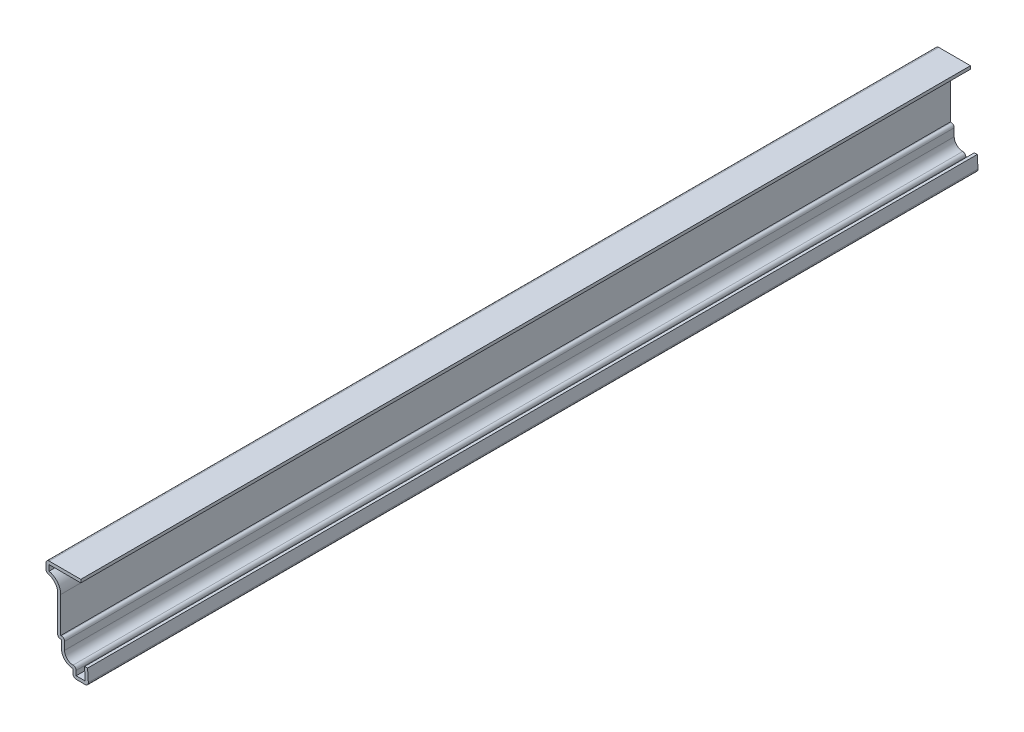
ISO-10303-21;
HEADER;
FILE_DESCRIPTION(('STEP AP214'),'2;1');
FILE_NAME('part.step','',(''),(''),'','','');
FILE_SCHEMA(('AUTOMOTIVE_DESIGN { 1 0 10303 214 1 1 1 1 }'));
ENDSEC;
DATA;
#1=APPLICATION_CONTEXT('core data for automotive mechanical design processes');
#2=APPLICATION_PROTOCOL_DEFINITION('international standard','automotive_design',2000,#1);
#3=PRODUCT_CONTEXT('',#1,'mechanical');
#4=PRODUCT('Part','Part','',(#3));
#5=PRODUCT_RELATED_PRODUCT_CATEGORY('part','',(#4));
#6=PRODUCT_DEFINITION_FORMATION('','',#4);
#7=PRODUCT_DEFINITION_CONTEXT('part definition',#1,'design');
#8=PRODUCT_DEFINITION('design','',#6,#7);
#9=PRODUCT_DEFINITION_SHAPE('','',#8);
#10=(LENGTH_UNIT() NAMED_UNIT(*) SI_UNIT(.MILLI.,.METRE.));
#11=(NAMED_UNIT(*) PLANE_ANGLE_UNIT() SI_UNIT($,.RADIAN.));
#12=(NAMED_UNIT(*) SI_UNIT($,.STERADIAN.) SOLID_ANGLE_UNIT());
#13=UNCERTAINTY_MEASURE_WITH_UNIT(LENGTH_MEASURE(1.E-05),#10,'distance_accuracy_value','');
#14=(GEOMETRIC_REPRESENTATION_CONTEXT(3) GLOBAL_UNCERTAINTY_ASSIGNED_CONTEXT((#13)) GLOBAL_UNIT_ASSIGNED_CONTEXT((#10,
#11,#12)) REPRESENTATION_CONTEXT('',''));
#15=CARTESIAN_POINT('',(0.,0.,0.));
#16=DIRECTION('',(0.,0.,1.));
#17=DIRECTION('',(1.,0.,0.));
#18=AXIS2_PLACEMENT_3D('',#15,#16,#17);
#19=CARTESIAN_POINT('',(-17.4625,35.2425,-365.125));
#20=DIRECTION('',(0.,-1.,0.));
#21=DIRECTION('',(1.,0.,0.));
#22=AXIS2_PLACEMENT_3D('',#19,#20,#21);
#23=PLANE('',#22);
#24=DIRECTION('',(1.,0.,0.));
#25=VECTOR('',#24,1.);
#26=CARTESIAN_POINT('',(-17.4625,35.2425,0.));
#27=LINE('',#26,#25);
#28=CARTESIAN_POINT('',(-16.1925,35.2425,0.));
#29=VERTEX_POINT('',#28);
#30=CARTESIAN_POINT('',(-3.175,35.2425,0.));
#31=VERTEX_POINT('',#30);
#32=EDGE_CURVE('E305',#29,#31,#27,.T.);
#33=ORIENTED_EDGE('',*,*,#32,.F.);
#34=DIRECTION('',(0.,0.,1.));
#35=VECTOR('',#34,1.);
#36=CARTESIAN_POINT('',(-16.1925,35.2425,-365.125));
#37=LINE('',#36,#35);
#38=CARTESIAN_POINT('',(-16.1925,35.2425,-365.125));
#39=VERTEX_POINT('',#38);
#40=EDGE_CURVE('E251',#39,#29,#37,.T.);
#41=ORIENTED_EDGE('',*,*,#40,.F.);
#42=DIRECTION('',(1.,0.,0.));
#43=VECTOR('',#42,1.);
#44=CARTESIAN_POINT('',(-17.4625,35.2425,-365.125));
#45=LINE('',#44,#43);
#46=CARTESIAN_POINT('',(-3.175,35.2425,-365.125));
#47=VERTEX_POINT('',#46);
#48=EDGE_CURVE('E233',#39,#47,#45,.T.);
#49=ORIENTED_EDGE('',*,*,#48,.T.);
#50=DIRECTION('',(0.,0.,1.));
#51=VECTOR('',#50,1.);
#52=CARTESIAN_POINT('',(-3.175,35.2425,-365.125));
#53=LINE('',#52,#51);
#54=EDGE_CURVE('E241',#47,#31,#53,.T.);
#55=ORIENTED_EDGE('',*,*,#54,.T.);
#56=EDGE_LOOP('',(#33,#41,#49,#55));
#57=FACE_BOUND('',#56,.T.);
#58=ADVANCED_FACE('F35',(#57),#23,.T.);
#59=CARTESIAN_POINT('',(-16.1925,31.75,-365.125));
#60=DIRECTION('',(1.,0.,0.));
#61=DIRECTION('',(0.,0.,-1.));
#62=AXIS2_PLACEMENT_3D('',#59,#60,#61);
#63=PLANE('',#62);
#64=DIRECTION('',(0.,1.,0.));
#65=VECTOR('',#64,1.);
#66=CARTESIAN_POINT('',(-16.1925,31.75,0.));
#67=LINE('',#66,#65);
#68=CARTESIAN_POINT('',(-16.1925,32.8848007596696,0.));
#69=VERTEX_POINT('',#68);
#70=EDGE_CURVE('E252',#69,#29,#67,.T.);
#71=ORIENTED_EDGE('',*,*,#70,.F.);
#72=DIRECTION('',(0.,0.,1.));
#73=VECTOR('',#72,1.);
#74=CARTESIAN_POINT('',(-16.1925,32.8848007596696,-365.125));
#75=LINE('',#74,#73);
#76=CARTESIAN_POINT('',(-16.1925,32.8848007596696,-365.125));
#77=VERTEX_POINT('',#76);
#78=EDGE_CURVE('E357',#77,#69,#75,.T.);
#79=ORIENTED_EDGE('',*,*,#78,.F.);
#80=DIRECTION('',(0.,1.,0.));
#81=VECTOR('',#80,1.);
#82=CARTESIAN_POINT('',(-16.1925,31.75,-365.125));
#83=LINE('',#82,#81);
#84=EDGE_CURVE('E249',#77,#39,#83,.T.);
#85=ORIENTED_EDGE('',*,*,#84,.T.);
#86=ORIENTED_EDGE('',*,*,#40,.T.);
#87=EDGE_LOOP('',(#71,#79,#85,#86));
#88=FACE_BOUND('',#87,.T.);
#89=ADVANCED_FACE('F467',(#88),#63,.T.);
#90=CARTESIAN_POINT('',(-17.4625,26.9875,-365.125));
#91=DIRECTION('',(0.,0.,1.));
#92=DIRECTION('',(1.,0.,0.));
#93=AXIS2_PLACEMENT_3D('',#90,#91,#92);
#94=CYLINDRICAL_SURFACE('',#93,6.0325);
#95=CARTESIAN_POINT('',(-17.4625,26.9875,0.));
#96=DIRECTION('',(0.,0.,1.));
#97=DIRECTION('',(1.,0.,0.));
#98=AXIS2_PLACEMENT_3D('',#95,#96,#97);
#99=CIRCLE('',#98,6.0325);
#100=CARTESIAN_POINT('',(-11.43,26.9875,0.));
#101=VERTEX_POINT('',#100);
#102=EDGE_CURVE('E255',#101,#69,#99,.T.);
#103=ORIENTED_EDGE('',*,*,#102,.F.);
#104=DIRECTION('',(0.,0.,1.));
#105=VECTOR('',#104,1.);
#106=CARTESIAN_POINT('',(-11.43,26.9875,-365.125));
#107=LINE('',#106,#105);
#108=CARTESIAN_POINT('',(-11.43,26.9875,-365.125));
#109=VERTEX_POINT('',#108);
#110=EDGE_CURVE('E359',#109,#101,#107,.T.);
#111=ORIENTED_EDGE('',*,*,#110,.F.);
#112=CARTESIAN_POINT('',(-17.4625,26.9875,-365.125));
#113=DIRECTION('',(0.,0.,1.));
#114=DIRECTION('',(1.,0.,0.));
#115=AXIS2_PLACEMENT_3D('',#112,#113,#114);
#116=CIRCLE('',#115,6.0325);
#117=EDGE_CURVE('E301',#109,#77,#116,.T.);
#118=ORIENTED_EDGE('',*,*,#117,.T.);
#119=ORIENTED_EDGE('',*,*,#78,.T.);
#120=EDGE_LOOP('',(#103,#111,#118,#119));
#121=FACE_BOUND('',#120,.T.);
#122=ADVANCED_FACE('F571',(#121),#94,.T.);
#123=CARTESIAN_POINT('',(-11.43,11.1125,-365.125));
#124=DIRECTION('',(1.,0.,0.));
#125=DIRECTION('',(0.,0.,-1.));
#126=AXIS2_PLACEMENT_3D('',#123,#124,#125);
#127=PLANE('',#126);
#128=DIRECTION('',(0.,1.,0.));
#129=VECTOR('',#128,1.);
#130=CARTESIAN_POINT('',(-11.43,11.1125,0.));
#131=LINE('',#130,#129);
#132=CARTESIAN_POINT('',(-11.43,12.3825,0.));
#133=VERTEX_POINT('',#132);
#134=EDGE_CURVE('E350',#133,#101,#131,.T.);
#135=ORIENTED_EDGE('',*,*,#134,.F.);
#136=DIRECTION('',(0.,0.,1.));
#137=VECTOR('',#136,1.);
#138=CARTESIAN_POINT('',(-11.43,12.3825,-365.125));
#139=LINE('',#138,#137);
#140=CARTESIAN_POINT('',(-11.43,12.3825,-365.125));
#141=VERTEX_POINT('',#140);
#142=EDGE_CURVE('E361',#141,#133,#139,.T.);
#143=ORIENTED_EDGE('',*,*,#142,.F.);
#144=DIRECTION('',(0.,1.,0.));
#145=VECTOR('',#144,1.);
#146=CARTESIAN_POINT('',(-11.43,11.1125,-365.125));
#147=LINE('',#146,#145);
#148=EDGE_CURVE('E298',#141,#109,#147,.T.);
#149=ORIENTED_EDGE('',*,*,#148,.T.);
#150=ORIENTED_EDGE('',*,*,#110,.T.);
#151=EDGE_LOOP('',(#135,#143,#149,#150));
#152=FACE_BOUND('',#151,.T.);
#153=ADVANCED_FACE('F475',(#152),#127,.T.);
#154=CARTESIAN_POINT('',(-11.1125,12.3825,-365.125));
#155=DIRECTION('',(0.,1.,0.));
#156=DIRECTION('',(0.,0.,1.));
#157=AXIS2_PLACEMENT_3D('',#154,#155,#156);
#158=PLANE('',#157);
#159=DIRECTION('',(1.,0.,0.));
#160=VECTOR('',#159,1.);
#161=CARTESIAN_POINT('',(-11.1125,12.3825,0.));
#162=LINE('',#161,#160);
#163=CARTESIAN_POINT('',(-11.1125,12.3825,0.));
#164=VERTEX_POINT('',#163);
#165=EDGE_CURVE('E348',#164,#133,#162,.F.);
#166=ORIENTED_EDGE('',*,*,#165,.F.);
#167=DIRECTION('',(0.,0.,1.));
#168=VECTOR('',#167,1.);
#169=CARTESIAN_POINT('',(-11.1125,12.3825,-365.125));
#170=LINE('',#169,#168);
#171=CARTESIAN_POINT('',(-11.1125,12.3825,-365.125));
#172=VERTEX_POINT('',#171);
#173=EDGE_CURVE('E433',#164,#172,#170,.F.);
#174=ORIENTED_EDGE('',*,*,#173,.T.);
#175=DIRECTION('',(1.,0.,0.));
#176=VECTOR('',#175,1.);
#177=CARTESIAN_POINT('',(-11.1125,12.3825,-365.125));
#178=LINE('',#177,#176);
#179=EDGE_CURVE('E296',#172,#141,#178,.F.);
#180=ORIENTED_EDGE('',*,*,#179,.T.);
#181=ORIENTED_EDGE('',*,*,#142,.T.);
#182=EDGE_LOOP('',(#166,#174,#180,#181));
#183=FACE_BOUND('',#182,.T.);
#184=ADVANCED_FACE('F478',(#183),#158,.T.);
#185=CARTESIAN_POINT('',(-9.8425,7.9375,-365.125));
#186=DIRECTION('',(1.,0.,0.));
#187=DIRECTION('',(0.,1.,0.));
#188=AXIS2_PLACEMENT_3D('',#185,#186,#187);
#189=PLANE('',#188);
#190=DIRECTION('',(0.,1.,0.));
#191=VECTOR('',#190,1.);
#192=CARTESIAN_POINT('',(-9.8425,7.9375,-365.125));
#193=LINE('',#192,#191);
#194=CARTESIAN_POINT('',(-9.8425,7.9375,-365.125));
#195=VERTEX_POINT('',#194);
#196=CARTESIAN_POINT('',(-9.8425,11.1125,-365.125));
#197=VERTEX_POINT('',#196);
#198=EDGE_CURVE('E293',#195,#197,#193,.T.);
#199=ORIENTED_EDGE('',*,*,#198,.T.);
#200=DIRECTION('',(0.,0.,1.));
#201=VECTOR('',#200,1.);
#202=CARTESIAN_POINT('',(-9.8425,11.1125,-365.125));
#203=LINE('',#202,#201);
#204=CARTESIAN_POINT('',(-9.8425,11.1125,0.));
#205=VERTEX_POINT('',#204);
#206=EDGE_CURVE('E430',#197,#205,#203,.T.);
#207=ORIENTED_EDGE('',*,*,#206,.T.);
#208=DIRECTION('',(0.,1.,0.));
#209=VECTOR('',#208,1.);
#210=CARTESIAN_POINT('',(-9.8425,7.9375,0.));
#211=LINE('',#210,#209);
#212=CARTESIAN_POINT('',(-9.8425,7.9375,0.));
#213=VERTEX_POINT('',#212);
#214=EDGE_CURVE('E345',#213,#205,#211,.T.);
#215=ORIENTED_EDGE('',*,*,#214,.F.);
#216=DIRECTION('',(0.,0.,1.));
#217=VECTOR('',#216,1.);
#218=CARTESIAN_POINT('',(-9.8425,7.9375,-365.125));
#219=LINE('',#218,#217);
#220=EDGE_CURVE('E364',#195,#213,#219,.T.);
#221=ORIENTED_EDGE('',*,*,#220,.F.);
#222=EDGE_LOOP('',(#199,#207,#215,#221));
#223=FACE_BOUND('',#222,.T.);
#224=ADVANCED_FACE('F487',(#223),#189,.T.);
#225=CARTESIAN_POINT('',(-6.35,7.9375,-365.125));
#226=DIRECTION('',(0.,0.,1.));
#227=DIRECTION('',(1.,0.,0.));
#228=AXIS2_PLACEMENT_3D('',#225,#226,#227);
#229=CYLINDRICAL_SURFACE('',#228,3.4925);
#230=CARTESIAN_POINT('',(-6.35,7.9375,0.));
#231=DIRECTION('',(0.,0.,1.));
#232=DIRECTION('',(1.,0.,0.));
#233=AXIS2_PLACEMENT_3D('',#230,#231,#232);
#234=CIRCLE('',#233,3.4925);
#235=CARTESIAN_POINT('',(-6.35,4.445,0.));
#236=VERTEX_POINT('',#235);
#237=EDGE_CURVE('E343',#236,#213,#234,.F.);
#238=ORIENTED_EDGE('',*,*,#237,.F.);
#239=DIRECTION('',(0.,0.,1.));
#240=VECTOR('',#239,1.);
#241=CARTESIAN_POINT('',(-6.35,4.445,-365.125));
#242=LINE('',#241,#240);
#243=CARTESIAN_POINT('',(-6.35,4.445,-365.125));
#244=VERTEX_POINT('',#243);
#245=EDGE_CURVE('E428',#236,#244,#242,.F.);
#246=ORIENTED_EDGE('',*,*,#245,.T.);
#247=CARTESIAN_POINT('',(-6.35,7.9375,-365.125));
#248=DIRECTION('',(0.,0.,1.));
#249=DIRECTION('',(1.,0.,0.));
#250=AXIS2_PLACEMENT_3D('',#247,#248,#249);
#251=CIRCLE('',#250,3.4925);
#252=EDGE_CURVE('E291',#244,#195,#251,.F.);
#253=ORIENTED_EDGE('',*,*,#252,.T.);
#254=ORIENTED_EDGE('',*,*,#220,.T.);
#255=EDGE_LOOP('',(#238,#246,#253,#254));
#256=FACE_BOUND('',#255,.T.);
#257=ADVANCED_FACE('F492',(#256),#229,.F.);
#258=CARTESIAN_POINT('',(-5.08,0.,-365.125));
#259=DIRECTION('',(1.,0.,0.));
#260=DIRECTION('',(0.,1.,0.));
#261=AXIS2_PLACEMENT_3D('',#258,#259,#260);
#262=PLANE('',#261);
#263=DIRECTION('',(0.,1.,0.));
#264=VECTOR('',#263,1.);
#265=CARTESIAN_POINT('',(-5.08,0.,-365.125));
#266=LINE('',#265,#264);
#267=CARTESIAN_POINT('',(-5.08,1.27,-365.125));
#268=VERTEX_POINT('',#267);
#269=CARTESIAN_POINT('',(-5.08,3.175,-365.125));
#270=VERTEX_POINT('',#269);
#271=EDGE_CURVE('E288',#268,#270,#266,.T.);
#272=ORIENTED_EDGE('',*,*,#271,.T.);
#273=DIRECTION('',(0.,0.,1.));
#274=VECTOR('',#273,1.);
#275=CARTESIAN_POINT('',(-5.08,3.175,-365.125));
#276=LINE('',#275,#274);
#277=CARTESIAN_POINT('',(-5.08,3.175,0.));
#278=VERTEX_POINT('',#277);
#279=EDGE_CURVE('E425',#270,#278,#276,.T.);
#280=ORIENTED_EDGE('',*,*,#279,.T.);
#281=DIRECTION('',(0.,1.,0.));
#282=VECTOR('',#281,1.);
#283=CARTESIAN_POINT('',(-5.08,0.,0.));
#284=LINE('',#283,#282);
#285=CARTESIAN_POINT('',(-5.08,1.27,0.));
#286=VERTEX_POINT('',#285);
#287=EDGE_CURVE('E340',#286,#278,#284,.T.);
#288=ORIENTED_EDGE('',*,*,#287,.F.);
#289=DIRECTION('',(0.,0.,1.));
#290=VECTOR('',#289,1.);
#291=CARTESIAN_POINT('',(-5.08,1.27,-365.125));
#292=LINE('',#291,#290);
#293=EDGE_CURVE('E367',#268,#286,#292,.T.);
#294=ORIENTED_EDGE('',*,*,#293,.F.);
#295=EDGE_LOOP('',(#272,#280,#288,#294));
#296=FACE_BOUND('',#295,.T.);
#297=ADVANCED_FACE('F501',(#296),#262,.T.);
#298=CARTESIAN_POINT('',(0.,1.27,-365.125));
#299=DIRECTION('',(0.,1.,0.));
#300=DIRECTION('',(-1.,0.,0.));
#301=AXIS2_PLACEMENT_3D('',#298,#299,#300);
#302=PLANE('',#301);
#303=DIRECTION('',(-1.,0.,0.));
#304=VECTOR('',#303,1.);
#305=CARTESIAN_POINT('',(0.,1.27,0.));
#306=LINE('',#305,#304);
#307=CARTESIAN_POINT('',(-1.35185305113684,1.27,0.));
#308=VERTEX_POINT('',#307);
#309=EDGE_CURVE('E337',#308,#286,#306,.T.);
#310=ORIENTED_EDGE('',*,*,#309,.F.);
#311=DIRECTION('',(0.,0.,1.));
#312=VECTOR('',#311,1.);
#313=CARTESIAN_POINT('',(-1.35185305113684,1.27,-365.125));
#314=LINE('',#313,#312);
#315=CARTESIAN_POINT('',(-1.35185305113684,1.27,-365.125));
#316=VERTEX_POINT('',#315);
#317=EDGE_CURVE('E369',#316,#308,#314,.T.);
#318=ORIENTED_EDGE('',*,*,#317,.F.);
#319=DIRECTION('',(-1.,0.,0.));
#320=VECTOR('',#319,1.);
#321=CARTESIAN_POINT('',(0.,1.27,-365.125));
#322=LINE('',#321,#320);
#323=EDGE_CURVE('E285',#316,#268,#322,.T.);
#324=ORIENTED_EDGE('',*,*,#323,.T.);
#325=ORIENTED_EDGE('',*,*,#293,.T.);
#326=EDGE_LOOP('',(#310,#318,#324,#325));
#327=FACE_BOUND('',#326,.T.);
#328=ADVANCED_FACE('F506',(#327),#302,.T.);
#329=CARTESIAN_POINT('',(-1.66440177467327,6.27077957658292,-365.125));
#330=DIRECTION('',(-0.998052578482889,-0.0623782861551807,0.));
#331=DIRECTION('',(0.0623782861551807,-0.998052578482889,0.));
#332=AXIS2_PLACEMENT_3D('',#329,#330,#331);
#333=PLANE('',#332);
#334=DIRECTION('',(0.0623782861551807,-0.998052578482889,0.));
#335=VECTOR('',#334,1.);
#336=CARTESIAN_POINT('',(-1.66440177467327,6.27077957658292,0.));
#337=LINE('',#336,#335);
#338=CARTESIAN_POINT('',(-1.66440177467327,6.27077957658292,0.));
#339=VERTEX_POINT('',#338);
#340=EDGE_CURVE('E334',#339,#308,#337,.T.);
#341=ORIENTED_EDGE('',*,*,#340,.F.);
#342=DIRECTION('',(0.,0.,1.));
#343=VECTOR('',#342,1.);
#344=CARTESIAN_POINT('',(-1.66440177467327,6.27077957658292,-365.125));
#345=LINE('',#344,#343);
#346=CARTESIAN_POINT('',(-1.66440177467327,6.27077957658292,-365.125));
#347=VERTEX_POINT('',#346);
#348=EDGE_CURVE('E371',#347,#339,#345,.T.);
#349=ORIENTED_EDGE('',*,*,#348,.F.);
#350=DIRECTION('',(0.0623782861551807,-0.998052578482889,0.));
#351=VECTOR('',#350,1.);
#352=CARTESIAN_POINT('',(-1.66440177467327,6.27077957658292,-365.125));
#353=LINE('',#352,#351);
#354=EDGE_CURVE('E282',#347,#316,#353,.T.);
#355=ORIENTED_EDGE('',*,*,#354,.T.);
#356=ORIENTED_EDGE('',*,*,#317,.T.);
#357=EDGE_LOOP('',(#341,#349,#355,#356));
#358=FACE_BOUND('',#357,.T.);
#359=ADVANCED_FACE('F510',(#358),#333,.T.);
#360=CARTESIAN_POINT('',(-1.66440177467327,6.27077957658292,-365.125));
#361=DIRECTION('',(0.0623782861551808,-0.998052578482889,0.));
#362=DIRECTION('',(0.998052578482889,0.0623782861551809,0.));
#363=AXIS2_PLACEMENT_3D('',#360,#361,#362);
#364=PLANE('',#363);
#365=DIRECTION('',(0.998052578482889,0.0623782861551808,0.));
#366=VECTOR('',#365,1.);
#367=CARTESIAN_POINT('',(-1.66440177467327,6.27077957658292,0.));
#368=LINE('',#367,#366);
#369=CARTESIAN_POINT('',(-0.396875000000001,6.35,0.));
#370=VERTEX_POINT('',#369);
#371=EDGE_CURVE('E332',#339,#370,#368,.T.);
#372=ORIENTED_EDGE('',*,*,#371,.T.);
#373=DIRECTION('',(0.,0.,1.));
#374=VECTOR('',#373,1.);
#375=CARTESIAN_POINT('',(-0.396875000000001,6.35,-365.125));
#376=LINE('',#375,#374);
#377=CARTESIAN_POINT('',(-0.396875000000001,6.35,-365.125));
#378=VERTEX_POINT('',#377);
#379=EDGE_CURVE('E373',#378,#370,#376,.T.);
#380=ORIENTED_EDGE('',*,*,#379,.F.);
#381=DIRECTION('',(0.998052578482889,0.0623782861551808,0.));
#382=VECTOR('',#381,1.);
#383=CARTESIAN_POINT('',(-1.66440177467327,6.27077957658292,-365.125));
#384=LINE('',#383,#382);
#385=EDGE_CURVE('E280',#347,#378,#384,.T.);
#386=ORIENTED_EDGE('',*,*,#385,.F.);
#387=ORIENTED_EDGE('',*,*,#348,.T.);
#388=EDGE_LOOP('',(#372,#380,#386,#387));
#389=FACE_BOUND('',#388,.T.);
#390=ADVANCED_FACE('F514',(#389),#364,.F.);
#391=CARTESIAN_POINT('',(-0.396875000000001,6.35,-365.125));
#392=DIRECTION('',(-0.998052578482889,-0.0623782861551807,0.));
#393=DIRECTION('',(0.0623782861551807,-0.998052578482889,0.));
#394=AXIS2_PLACEMENT_3D('',#391,#392,#393);
#395=PLANE('',#394);
#396=DIRECTION('',(0.0623782861551807,-0.998052578482889,0.));
#397=VECTOR('',#396,1.);
#398=CARTESIAN_POINT('',(-0.396875000000001,6.35,0.));
#399=LINE('',#398,#397);
#400=CARTESIAN_POINT('',(-0.0843262764635677,1.34922042341708,0.));
#401=VERTEX_POINT('',#400);
#402=EDGE_CURVE('E329',#370,#401,#399,.T.);
#403=ORIENTED_EDGE('',*,*,#402,.T.);
#404=DIRECTION('',(0.,0.,1.));
#405=VECTOR('',#404,1.);
#406=CARTESIAN_POINT('',(-0.0843262764635677,1.34922042341708,-365.125));
#407=LINE('',#406,#405);
#408=CARTESIAN_POINT('',(-0.0843262764635677,1.34922042341708,-365.125));
#409=VERTEX_POINT('',#408);
#410=EDGE_CURVE('E407',#401,#409,#407,.F.);
#411=ORIENTED_EDGE('',*,*,#410,.T.);
#412=DIRECTION('',(0.0623782861551807,-0.998052578482889,0.));
#413=VECTOR('',#412,1.);
#414=CARTESIAN_POINT('',(-0.396875000000001,6.35,-365.125));
#415=LINE('',#414,#413);
#416=EDGE_CURVE('E278',#378,#409,#415,.T.);
#417=ORIENTED_EDGE('',*,*,#416,.F.);
#418=ORIENTED_EDGE('',*,*,#379,.T.);
#419=EDGE_LOOP('',(#403,#411,#417,#418));
#420=FACE_BOUND('',#419,.T.);
#421=ADVANCED_FACE('F696',(#420),#395,.F.);
#422=CARTESIAN_POINT('',(0.,0.,-365.125));
#423=DIRECTION('',(0.,1.,0.));
#424=DIRECTION('',(-1.,0.,0.));
#425=AXIS2_PLACEMENT_3D('',#422,#423,#424);
#426=PLANE('',#425);
#427=DIRECTION('',(-1.,0.,0.));
#428=VECTOR('',#427,1.);
#429=CARTESIAN_POINT('',(0.,0.,-365.125));
#430=LINE('',#429,#428);
#431=CARTESIAN_POINT('',(-1.35185305113684,0.,-365.125));
#432=VERTEX_POINT('',#431);
#433=CARTESIAN_POINT('',(-5.08,0.,-365.125));
#434=VERTEX_POINT('',#433);
#435=EDGE_CURVE('E275',#432,#434,#430,.T.);
#436=ORIENTED_EDGE('',*,*,#435,.F.);
#437=DIRECTION('',(0.,0.,1.));
#438=VECTOR('',#437,1.);
#439=CARTESIAN_POINT('',(-1.35185305113684,0.,-365.125));
#440=LINE('',#439,#438);
#441=CARTESIAN_POINT('',(-1.35185305113684,0.,0.));
#442=VERTEX_POINT('',#441);
#443=EDGE_CURVE('E390',#432,#442,#440,.T.);
#444=ORIENTED_EDGE('',*,*,#443,.T.);
#445=DIRECTION('',(-1.,0.,0.));
#446=VECTOR('',#445,1.);
#447=CARTESIAN_POINT('',(0.,0.,0.));
#448=LINE('',#447,#446);
#449=CARTESIAN_POINT('',(-5.08,0.,0.));
#450=VERTEX_POINT('',#449);
#451=EDGE_CURVE('E326',#442,#450,#448,.T.);
#452=ORIENTED_EDGE('',*,*,#451,.T.);
#453=DIRECTION('',(0.,0.,1.));
#454=VECTOR('',#453,1.);
#455=CARTESIAN_POINT('',(-5.08,0.,-365.125));
#456=LINE('',#455,#454);
#457=EDGE_CURVE('E356',#450,#434,#456,.F.);
#458=ORIENTED_EDGE('',*,*,#457,.T.);
#459=EDGE_LOOP('',(#436,#444,#452,#458));
#460=FACE_BOUND('',#459,.T.);
#461=ADVANCED_FACE('F524',(#460),#426,.F.);
#462=CARTESIAN_POINT('',(-6.35,0.,-365.125));
#463=DIRECTION('',(1.,0.,0.));
#464=DIRECTION('',(0.,1.,0.));
#465=AXIS2_PLACEMENT_3D('',#462,#463,#464);
#466=PLANE('',#465);
#467=DIRECTION('',(0.,1.,0.));
#468=VECTOR('',#467,1.);
#469=CARTESIAN_POINT('',(-6.35,0.,-365.125));
#470=LINE('',#469,#468);
#471=CARTESIAN_POINT('',(-6.35,1.27,-365.125));
#472=VERTEX_POINT('',#471);
#473=CARTESIAN_POINT('',(-6.35,3.175,-365.125));
#474=VERTEX_POINT('',#473);
#475=EDGE_CURVE('E273',#472,#474,#470,.T.);
#476=ORIENTED_EDGE('',*,*,#475,.F.);
#477=DIRECTION('',(0.,0.,1.));
#478=VECTOR('',#477,1.);
#479=CARTESIAN_POINT('',(-6.35,1.27,-365.125));
#480=LINE('',#479,#478);
#481=CARTESIAN_POINT('',(-6.35,1.27,0.));
#482=VERTEX_POINT('',#481);
#483=EDGE_CURVE('E422',#472,#482,#480,.T.);
#484=ORIENTED_EDGE('',*,*,#483,.T.);
#485=DIRECTION('',(0.,1.,0.));
#486=VECTOR('',#485,1.);
#487=CARTESIAN_POINT('',(-6.35,0.,0.));
#488=LINE('',#487,#486);
#489=CARTESIAN_POINT('',(-6.35,3.175,0.));
#490=VERTEX_POINT('',#489);
#491=EDGE_CURVE('E324',#482,#490,#488,.T.);
#492=ORIENTED_EDGE('',*,*,#491,.T.);
#493=DIRECTION('',(0.,0.,1.));
#494=VECTOR('',#493,1.);
#495=CARTESIAN_POINT('',(-6.35,3.175,-365.125));
#496=LINE('',#495,#494);
#497=EDGE_CURVE('E376',#474,#490,#496,.T.);
#498=ORIENTED_EDGE('',*,*,#497,.F.);
#499=EDGE_LOOP('',(#476,#484,#492,#498));
#500=FACE_BOUND('',#499,.T.);
#501=ADVANCED_FACE('F535',(#500),#466,.F.);
#502=CARTESIAN_POINT('',(-6.35,7.9375,-365.125));
#503=DIRECTION('',(0.,0.,1.));
#504=DIRECTION('',(1.,0.,0.));
#505=AXIS2_PLACEMENT_3D('',#502,#503,#504);
#506=CYLINDRICAL_SURFACE('',#505,4.7625);
#507=CARTESIAN_POINT('',(-6.35,7.9375,0.));
#508=DIRECTION('',(0.,0.,-1.));
#509=DIRECTION('',(-1.,0.,0.));
#510=AXIS2_PLACEMENT_3D('',#507,#508,#509);
#511=CIRCLE('',#510,4.7625);
#512=CARTESIAN_POINT('',(-11.1125,7.9375,0.));
#513=VERTEX_POINT('',#512);
#514=EDGE_CURVE('E322',#490,#513,#511,.T.);
#515=ORIENTED_EDGE('',*,*,#514,.T.);
#516=DIRECTION('',(0.,0.,1.));
#517=VECTOR('',#516,1.);
#518=CARTESIAN_POINT('',(-11.1125,7.9375,-365.125));
#519=LINE('',#518,#517);
#520=CARTESIAN_POINT('',(-11.1125,7.9375,-365.125));
#521=VERTEX_POINT('',#520);
#522=EDGE_CURVE('E379',#521,#513,#519,.T.);
#523=ORIENTED_EDGE('',*,*,#522,.F.);
#524=CARTESIAN_POINT('',(-6.35,7.9375,-365.125));
#525=DIRECTION('',(0.,0.,-1.));
#526=DIRECTION('',(-1.,0.,0.));
#527=AXIS2_PLACEMENT_3D('',#524,#525,#526);
#528=CIRCLE('',#527,4.7625);
#529=EDGE_CURVE('E271',#474,#521,#528,.T.);
#530=ORIENTED_EDGE('',*,*,#529,.F.);
#531=ORIENTED_EDGE('',*,*,#497,.T.);
#532=EDGE_LOOP('',(#515,#523,#530,#531));
#533=FACE_BOUND('',#532,.T.);
#534=ADVANCED_FACE('F542',(#533),#506,.T.);
#535=CARTESIAN_POINT('',(-11.1125,7.9375,-365.125));
#536=DIRECTION('',(1.,0.,0.));
#537=DIRECTION('',(0.,1.,0.));
#538=AXIS2_PLACEMENT_3D('',#535,#536,#537);
#539=PLANE('',#538);
#540=DIRECTION('',(0.,1.,0.));
#541=VECTOR('',#540,1.);
#542=CARTESIAN_POINT('',(-11.1125,7.9375,0.));
#543=LINE('',#542,#541);
#544=CARTESIAN_POINT('',(-11.1125,11.1125,0.));
#545=VERTEX_POINT('',#544);
#546=EDGE_CURVE('E320',#513,#545,#543,.T.);
#547=ORIENTED_EDGE('',*,*,#546,.T.);
#548=DIRECTION('',(0.,0.,1.));
#549=VECTOR('',#548,1.);
#550=CARTESIAN_POINT('',(-11.1125,11.1125,-365.125));
#551=LINE('',#550,#549);
#552=CARTESIAN_POINT('',(-11.1125,11.1125,-365.125));
#553=VERTEX_POINT('',#552);
#554=EDGE_CURVE('E382',#553,#545,#551,.T.);
#555=ORIENTED_EDGE('',*,*,#554,.F.);
#556=DIRECTION('',(0.,1.,0.));
#557=VECTOR('',#556,1.);
#558=CARTESIAN_POINT('',(-11.1125,7.9375,-365.125));
#559=LINE('',#558,#557);
#560=EDGE_CURVE('E269',#521,#553,#559,.T.);
#561=ORIENTED_EDGE('',*,*,#560,.F.);
#562=ORIENTED_EDGE('',*,*,#522,.T.);
#563=EDGE_LOOP('',(#547,#555,#561,#562));
#564=FACE_BOUND('',#563,.T.);
#565=ADVANCED_FACE('F545',(#564),#539,.F.);
#566=CARTESIAN_POINT('',(-11.1125,11.1125,-365.125));
#567=DIRECTION('',(0.,1.,0.));
#568=DIRECTION('',(0.,0.,1.));
#569=AXIS2_PLACEMENT_3D('',#566,#567,#568);
#570=PLANE('',#569);
#571=DIRECTION('',(-1.,0.,0.));
#572=VECTOR('',#571,1.);
#573=CARTESIAN_POINT('',(-11.1125,11.1125,0.));
#574=LINE('',#573,#572);
#575=CARTESIAN_POINT('',(-11.43,11.1125,0.));
#576=VERTEX_POINT('',#575);
#577=EDGE_CURVE('E317',#545,#576,#574,.T.);
#578=ORIENTED_EDGE('',*,*,#577,.T.);
#579=DIRECTION('',(0.,0.,1.));
#580=VECTOR('',#579,1.);
#581=CARTESIAN_POINT('',(-11.43,11.1125,-365.125));
#582=LINE('',#581,#580);
#583=CARTESIAN_POINT('',(-11.43,11.1125,-365.125));
#584=VERTEX_POINT('',#583);
#585=EDGE_CURVE('E438',#576,#584,#582,.F.);
#586=ORIENTED_EDGE('',*,*,#585,.T.);
#587=DIRECTION('',(-1.,0.,0.));
#588=VECTOR('',#587,1.);
#589=CARTESIAN_POINT('',(-11.1125,11.1125,-365.125));
#590=LINE('',#589,#588);
#591=EDGE_CURVE('E266',#553,#584,#590,.T.);
#592=ORIENTED_EDGE('',*,*,#591,.F.);
#593=ORIENTED_EDGE('',*,*,#554,.T.);
#594=EDGE_LOOP('',(#578,#586,#592,#593));
#595=FACE_BOUND('',#594,.T.);
#596=ADVANCED_FACE('F549',(#595),#570,.F.);
#597=CARTESIAN_POINT('',(-12.7,11.1125,-365.125));
#598=DIRECTION('',(1.,0.,0.));
#599=DIRECTION('',(0.,0.,-1.));
#600=AXIS2_PLACEMENT_3D('',#597,#598,#599);
#601=PLANE('',#600);
#602=DIRECTION('',(0.,1.,0.));
#603=VECTOR('',#602,1.);
#604=CARTESIAN_POINT('',(-12.7,11.1125,-365.125));
#605=LINE('',#604,#603);
#606=CARTESIAN_POINT('',(-12.7,12.3825,-365.125));
#607=VERTEX_POINT('',#606);
#608=CARTESIAN_POINT('',(-12.7,26.9875,-365.125));
#609=VERTEX_POINT('',#608);
#610=EDGE_CURVE('E264',#607,#609,#605,.T.);
#611=ORIENTED_EDGE('',*,*,#610,.F.);
#612=DIRECTION('',(0.,0.,1.));
#613=VECTOR('',#612,1.);
#614=CARTESIAN_POINT('',(-12.7,12.3825,-365.125));
#615=LINE('',#614,#613);
#616=CARTESIAN_POINT('',(-12.7,12.3825,0.));
#617=VERTEX_POINT('',#616);
#618=EDGE_CURVE('E435',#607,#617,#615,.T.);
#619=ORIENTED_EDGE('',*,*,#618,.T.);
#620=DIRECTION('',(0.,1.,0.));
#621=VECTOR('',#620,1.);
#622=CARTESIAN_POINT('',(-12.7,11.1125,0.));
#623=LINE('',#622,#621);
#624=CARTESIAN_POINT('',(-12.7,26.9875,0.));
#625=VERTEX_POINT('',#624);
#626=EDGE_CURVE('E315',#617,#625,#623,.T.);
#627=ORIENTED_EDGE('',*,*,#626,.T.);
#628=DIRECTION('',(0.,0.,1.));
#629=VECTOR('',#628,1.);
#630=CARTESIAN_POINT('',(-12.7,26.9875,-365.125));
#631=LINE('',#630,#629);
#632=EDGE_CURVE('E385',#609,#625,#631,.T.);
#633=ORIENTED_EDGE('',*,*,#632,.F.);
#634=EDGE_LOOP('',(#611,#619,#627,#633));
#635=FACE_BOUND('',#634,.T.);
#636=ADVANCED_FACE('F557',(#635),#601,.F.);
#637=CARTESIAN_POINT('',(-17.4625,26.9875,-365.125));
#638=DIRECTION('',(0.,0.,1.));
#639=DIRECTION('',(1.,0.,0.));
#640=AXIS2_PLACEMENT_3D('',#637,#638,#639);
#641=CYLINDRICAL_SURFACE('',#640,4.7625);
#642=CARTESIAN_POINT('',(-17.4625,26.9875,0.));
#643=DIRECTION('',(0.,0.,1.));
#644=DIRECTION('',(1.,0.,0.));
#645=AXIS2_PLACEMENT_3D('',#642,#643,#644);
#646=CIRCLE('',#645,4.7625);
#647=CARTESIAN_POINT('',(-16.4598684210526,31.6432637576339,0.));
#648=VERTEX_POINT('',#647);
#649=EDGE_CURVE('E312',#625,#648,#646,.T.);
#650=ORIENTED_EDGE('',*,*,#649,.T.);
#651=DIRECTION('',(0.,0.,1.));
#652=VECTOR('',#651,1.);
#653=CARTESIAN_POINT('',(-16.4598684210526,31.6432637576339,-365.125));
#654=LINE('',#653,#652);
#655=CARTESIAN_POINT('',(-16.4598684210526,31.6432637576339,-365.125));
#656=VERTEX_POINT('',#655);
#657=EDGE_CURVE('E43',#648,#656,#654,.F.);
#658=ORIENTED_EDGE('',*,*,#657,.T.);
#659=CARTESIAN_POINT('',(-17.4625,26.9875,-365.125));
#660=DIRECTION('',(0.,0.,1.));
#661=DIRECTION('',(1.,0.,0.));
#662=AXIS2_PLACEMENT_3D('',#659,#660,#661);
#663=CIRCLE('',#662,4.7625);
#664=EDGE_CURVE('E261',#609,#656,#663,.T.);
#665=ORIENTED_EDGE('',*,*,#664,.F.);
#666=ORIENTED_EDGE('',*,*,#632,.T.);
#667=EDGE_LOOP('',(#650,#658,#665,#666));
#668=FACE_BOUND('',#667,.T.);
#669=ADVANCED_FACE('F446',(#668),#641,.F.);
#670=CARTESIAN_POINT('',(-17.4625,31.75,-365.125));
#671=DIRECTION('',(1.,0.,0.));
#672=DIRECTION('',(0.,0.,-1.));
#673=AXIS2_PLACEMENT_3D('',#670,#671,#672);
#674=PLANE('',#673);
#675=DIRECTION('',(0.,1.,0.));
#676=VECTOR('',#675,1.);
#677=CARTESIAN_POINT('',(-17.4625,31.75,-365.125));
#678=LINE('',#677,#676);
#679=CARTESIAN_POINT('',(-17.4625,32.8848007596696,-365.125));
#680=VERTEX_POINT('',#679);
#681=CARTESIAN_POINT('',(-17.4625,35.2425,-365.125));
#682=VERTEX_POINT('',#681);
#683=EDGE_CURVE('E259',#680,#682,#678,.T.);
#684=ORIENTED_EDGE('',*,*,#683,.F.);
#685=DIRECTION('',(0.,0.,1.));
#686=VECTOR('',#685,1.);
#687=CARTESIAN_POINT('',(-17.4625,32.8848007596696,-365.125));
#688=LINE('',#687,#686);
#689=CARTESIAN_POINT('',(-17.4625,32.8848007596696,0.));
#690=VERTEX_POINT('',#689);
#691=EDGE_CURVE('E441',#680,#690,#688,.T.);
#692=ORIENTED_EDGE('',*,*,#691,.T.);
#693=DIRECTION('',(0.,1.,0.));
#694=VECTOR('',#693,1.);
#695=CARTESIAN_POINT('',(-17.4625,31.75,0.));
#696=LINE('',#695,#694);
#697=CARTESIAN_POINT('',(-17.4625,35.2425,0.));
#698=VERTEX_POINT('',#697);
#699=EDGE_CURVE('E310',#690,#698,#696,.T.);
#700=ORIENTED_EDGE('',*,*,#699,.T.);
#701=DIRECTION('',(0.,0.,1.));
#702=VECTOR('',#701,1.);
#703=CARTESIAN_POINT('',(-17.4625,35.2425,-365.125));
#704=LINE('',#703,#702);
#705=EDGE_CURVE('E58',#698,#682,#704,.F.);
#706=ORIENTED_EDGE('',*,*,#705,.T.);
#707=EDGE_LOOP('',(#684,#692,#700,#706));
#708=FACE_BOUND('',#707,.T.);
#709=ADVANCED_FACE('F455',(#708),#674,.F.);
#710=CARTESIAN_POINT('',(-17.4625,36.5125,-365.125));
#711=DIRECTION('',(0.,-1.,0.));
#712=DIRECTION('',(1.,0.,0.));
#713=AXIS2_PLACEMENT_3D('',#710,#711,#712);
#714=PLANE('',#713);
#715=DIRECTION('',(1.,0.,0.));
#716=VECTOR('',#715,1.);
#717=CARTESIAN_POINT('',(-17.4625,36.5125,-365.125));
#718=LINE('',#717,#716);
#719=CARTESIAN_POINT('',(-16.1925,36.5125,-365.125));
#720=VERTEX_POINT('',#719);
#721=CARTESIAN_POINT('',(-3.175,36.5125,-365.125));
#722=VERTEX_POINT('',#721);
#723=EDGE_CURVE('E235',#720,#722,#718,.T.);
#724=ORIENTED_EDGE('',*,*,#723,.F.);
#725=DIRECTION('',(0.,0.,1.));
#726=VECTOR('',#725,1.);
#727=CARTESIAN_POINT('',(-16.1925,36.5125,-365.125));
#728=LINE('',#727,#726);
#729=CARTESIAN_POINT('',(-16.1925,36.5125,0.));
#730=VERTEX_POINT('',#729);
#731=EDGE_CURVE('E11',#720,#730,#728,.T.);
#732=ORIENTED_EDGE('',*,*,#731,.T.);
#733=DIRECTION('',(1.,0.,0.));
#734=VECTOR('',#733,1.);
#735=CARTESIAN_POINT('',(-17.4625,36.5125,0.));
#736=LINE('',#735,#734);
#737=CARTESIAN_POINT('',(-3.175,36.5125,0.));
#738=VERTEX_POINT('',#737);
#739=EDGE_CURVE('E308',#730,#738,#736,.T.);
#740=ORIENTED_EDGE('',*,*,#739,.T.);
#741=DIRECTION('',(0.,0.,1.));
#742=VECTOR('',#741,1.);
#743=CARTESIAN_POINT('',(-3.175,36.5125,-365.125));
#744=LINE('',#743,#742);
#745=EDGE_CURVE('E248',#722,#738,#744,.T.);
#746=ORIENTED_EDGE('',*,*,#745,.F.);
#747=EDGE_LOOP('',(#724,#732,#740,#746));
#748=FACE_BOUND('',#747,.T.);
#749=ADVANCED_FACE('F463',(#748),#714,.F.);
#750=CARTESIAN_POINT('',(-3.175,36.5125,-365.125));
#751=DIRECTION('',(-1.,0.,0.));
#752=DIRECTION('',(0.,0.,1.));
#753=AXIS2_PLACEMENT_3D('',#750,#751,#752);
#754=PLANE('',#753);
#755=DIRECTION('',(0.,-1.,0.));
#756=VECTOR('',#755,1.);
#757=CARTESIAN_POINT('',(-3.175,36.5125,0.));
#758=LINE('',#757,#756);
#759=EDGE_CURVE('E244',#738,#31,#758,.T.);
#760=ORIENTED_EDGE('',*,*,#759,.T.);
#761=ORIENTED_EDGE('',*,*,#54,.F.);
#762=DIRECTION('',(0.,-1.,0.));
#763=VECTOR('',#762,1.);
#764=CARTESIAN_POINT('',(-3.175,36.5125,-365.125));
#765=LINE('',#764,#763);
#766=EDGE_CURVE('E227',#722,#47,#765,.T.);
#767=ORIENTED_EDGE('',*,*,#766,.F.);
#768=ORIENTED_EDGE('',*,*,#745,.T.);
#769=EDGE_LOOP('',(#760,#761,#767,#768));
#770=FACE_BOUND('',#769,.T.);
#771=ADVANCED_FACE('F242',(#770),#754,.F.);
#772=CARTESIAN_POINT('',(-17.4625,26.9875,-365.125));
#773=DIRECTION('',(0.,0.,1.));
#774=DIRECTION('',(1.,0.,0.));
#775=AXIS2_PLACEMENT_3D('',#772,#773,#774);
#776=PLANE('',#775);
#777=ORIENTED_EDGE('',*,*,#416,.T.);
#778=CARTESIAN_POINT('',(-1.35185305113684,1.27,-365.125));
#779=DIRECTION('',(0.,0.,1.));
#780=DIRECTION('',(1.,0.,0.));
#781=AXIS2_PLACEMENT_3D('',#778,#779,#780);
#782=CIRCLE('',#781,1.27);
#783=EDGE_CURVE('E420',#409,#432,#782,.F.);
#784=ORIENTED_EDGE('',*,*,#783,.T.);
#785=ORIENTED_EDGE('',*,*,#435,.T.);
#786=CARTESIAN_POINT('',(-5.08,1.27,-365.125));
#787=DIRECTION('',(0.,0.,1.));
#788=DIRECTION('',(1.,0.,0.));
#789=AXIS2_PLACEMENT_3D('',#786,#787,#788);
#790=CIRCLE('',#789,1.27);
#791=EDGE_CURVE('E418',#434,#472,#790,.F.);
#792=ORIENTED_EDGE('',*,*,#791,.T.);
#793=ORIENTED_EDGE('',*,*,#475,.T.);
#794=ORIENTED_EDGE('',*,*,#529,.T.);
#795=ORIENTED_EDGE('',*,*,#560,.T.);
#796=ORIENTED_EDGE('',*,*,#591,.T.);
#797=CARTESIAN_POINT('',(-11.43,12.3825,-365.125));
#798=DIRECTION('',(0.,0.,1.));
#799=DIRECTION('',(1.,0.,0.));
#800=AXIS2_PLACEMENT_3D('',#797,#798,#799);
#801=CIRCLE('',#800,1.27);
#802=EDGE_CURVE('E412',#584,#607,#801,.F.);
#803=ORIENTED_EDGE('',*,*,#802,.T.);
#804=ORIENTED_EDGE('',*,*,#610,.T.);
#805=ORIENTED_EDGE('',*,*,#664,.T.);
#806=CARTESIAN_POINT('',(-16.1925,32.8848007596696,-365.125));
#807=DIRECTION('',(0.,0.,1.));
#808=DIRECTION('',(1.,0.,0.));
#809=AXIS2_PLACEMENT_3D('',#806,#807,#808);
#810=CIRCLE('',#809,1.27);
#811=EDGE_CURVE('E410',#656,#680,#810,.F.);
#812=ORIENTED_EDGE('',*,*,#811,.T.);
#813=ORIENTED_EDGE('',*,*,#683,.T.);
#814=CARTESIAN_POINT('',(-16.1925,35.2425,-365.125));
#815=DIRECTION('',(0.,0.,1.));
#816=DIRECTION('',(1.,0.,0.));
#817=AXIS2_PLACEMENT_3D('',#814,#815,#816);
#818=CIRCLE('',#817,1.27);
#819=EDGE_CURVE('E50',#682,#720,#818,.F.);
#820=ORIENTED_EDGE('',*,*,#819,.T.);
#821=ORIENTED_EDGE('',*,*,#723,.T.);
#822=ORIENTED_EDGE('',*,*,#766,.T.);
#823=ORIENTED_EDGE('',*,*,#48,.F.);
#824=ORIENTED_EDGE('',*,*,#84,.F.);
#825=ORIENTED_EDGE('',*,*,#117,.F.);
#826=ORIENTED_EDGE('',*,*,#148,.F.);
#827=ORIENTED_EDGE('',*,*,#179,.F.);
#828=CARTESIAN_POINT('',(-11.1125,11.1125,-365.125));
#829=DIRECTION('',(0.,0.,1.));
#830=DIRECTION('',(1.,0.,0.));
#831=AXIS2_PLACEMENT_3D('',#828,#829,#830);
#832=CIRCLE('',#831,1.27);
#833=EDGE_CURVE('E414',#172,#197,#832,.F.);
#834=ORIENTED_EDGE('',*,*,#833,.T.);
#835=ORIENTED_EDGE('',*,*,#198,.F.);
#836=ORIENTED_EDGE('',*,*,#252,.F.);
#837=CARTESIAN_POINT('',(-6.35,3.175,-365.125));
#838=DIRECTION('',(0.,0.,1.));
#839=DIRECTION('',(1.,0.,0.));
#840=AXIS2_PLACEMENT_3D('',#837,#838,#839);
#841=CIRCLE('',#840,1.27);
#842=EDGE_CURVE('E416',#244,#270,#841,.F.);
#843=ORIENTED_EDGE('',*,*,#842,.T.);
#844=ORIENTED_EDGE('',*,*,#271,.F.);
#845=ORIENTED_EDGE('',*,*,#323,.F.);
#846=ORIENTED_EDGE('',*,*,#354,.F.);
#847=ORIENTED_EDGE('',*,*,#385,.T.);
#848=EDGE_LOOP('',(#777,#784,#785,#792,#793,#794,#795,#796,#803,#804,#805,#812,#813,#820,#821,
#822,#823,#824,#825,#826,#827,#834,#835,#836,#843,#844,#845,#846,#847));
#849=FACE_BOUND('',#848,.T.);
#850=ADVANCED_FACE('F230',(#849),#776,.F.);
#851=CARTESIAN_POINT('',(-17.4625,26.9875,0.));
#852=DIRECTION('',(0.,0.,1.));
#853=DIRECTION('',(1.,0.,0.));
#854=AXIS2_PLACEMENT_3D('',#851,#852,#853);
#855=PLANE('',#854);
#856=ORIENTED_EDGE('',*,*,#451,.F.);
#857=CARTESIAN_POINT('',(-1.35185305113684,1.27,0.));
#858=DIRECTION('',(0.,0.,1.));
#859=DIRECTION('',(1.,0.,0.));
#860=AXIS2_PLACEMENT_3D('',#857,#858,#859);
#861=CIRCLE('',#860,1.27);
#862=EDGE_CURVE('E405',#442,#401,#861,.T.);
#863=ORIENTED_EDGE('',*,*,#862,.T.);
#864=ORIENTED_EDGE('',*,*,#402,.F.);
#865=ORIENTED_EDGE('',*,*,#371,.F.);
#866=ORIENTED_EDGE('',*,*,#340,.T.);
#867=ORIENTED_EDGE('',*,*,#309,.T.);
#868=ORIENTED_EDGE('',*,*,#287,.T.);
#869=CARTESIAN_POINT('',(-6.35,3.175,0.));
#870=DIRECTION('',(0.,0.,1.));
#871=DIRECTION('',(1.,0.,0.));
#872=AXIS2_PLACEMENT_3D('',#869,#870,#871);
#873=CIRCLE('',#872,1.27);
#874=EDGE_CURVE('E401',#278,#236,#873,.T.);
#875=ORIENTED_EDGE('',*,*,#874,.T.);
#876=ORIENTED_EDGE('',*,*,#237,.T.);
#877=ORIENTED_EDGE('',*,*,#214,.T.);
#878=CARTESIAN_POINT('',(-11.1125,11.1125,0.));
#879=DIRECTION('',(0.,0.,1.));
#880=DIRECTION('',(1.,0.,0.));
#881=AXIS2_PLACEMENT_3D('',#878,#879,#880);
#882=CIRCLE('',#881,1.27);
#883=EDGE_CURVE('E399',#205,#164,#882,.T.);
#884=ORIENTED_EDGE('',*,*,#883,.T.);
#885=ORIENTED_EDGE('',*,*,#165,.T.);
#886=ORIENTED_EDGE('',*,*,#134,.T.);
#887=ORIENTED_EDGE('',*,*,#102,.T.);
#888=ORIENTED_EDGE('',*,*,#70,.T.);
#889=ORIENTED_EDGE('',*,*,#32,.T.);
#890=ORIENTED_EDGE('',*,*,#759,.F.);
#891=ORIENTED_EDGE('',*,*,#739,.F.);
#892=CARTESIAN_POINT('',(-16.1925,35.2425,0.));
#893=DIRECTION('',(0.,0.,1.));
#894=DIRECTION('',(1.,0.,0.));
#895=AXIS2_PLACEMENT_3D('',#892,#893,#894);
#896=CIRCLE('',#895,1.27);
#897=EDGE_CURVE('E393',#730,#698,#896,.T.);
#898=ORIENTED_EDGE('',*,*,#897,.T.);
#899=ORIENTED_EDGE('',*,*,#699,.F.);
#900=CARTESIAN_POINT('',(-16.1925,32.8848007596696,0.));
#901=DIRECTION('',(0.,0.,1.));
#902=DIRECTION('',(1.,0.,0.));
#903=AXIS2_PLACEMENT_3D('',#900,#901,#902);
#904=CIRCLE('',#903,1.27);
#905=EDGE_CURVE('E395',#690,#648,#904,.T.);
#906=ORIENTED_EDGE('',*,*,#905,.T.);
#907=ORIENTED_EDGE('',*,*,#649,.F.);
#908=ORIENTED_EDGE('',*,*,#626,.F.);
#909=CARTESIAN_POINT('',(-11.43,12.3825,0.));
#910=DIRECTION('',(0.,0.,1.));
#911=DIRECTION('',(1.,0.,0.));
#912=AXIS2_PLACEMENT_3D('',#909,#910,#911);
#913=CIRCLE('',#912,1.27);
#914=EDGE_CURVE('E397',#617,#576,#913,.T.);
#915=ORIENTED_EDGE('',*,*,#914,.T.);
#916=ORIENTED_EDGE('',*,*,#577,.F.);
#917=ORIENTED_EDGE('',*,*,#546,.F.);
#918=ORIENTED_EDGE('',*,*,#514,.F.);
#919=ORIENTED_EDGE('',*,*,#491,.F.);
#920=CARTESIAN_POINT('',(-5.08,1.27,0.));
#921=DIRECTION('',(0.,0.,1.));
#922=DIRECTION('',(1.,0.,0.));
#923=AXIS2_PLACEMENT_3D('',#920,#921,#922);
#924=CIRCLE('',#923,1.27);
#925=EDGE_CURVE('E403',#482,#450,#924,.T.);
#926=ORIENTED_EDGE('',*,*,#925,.T.);
#927=EDGE_LOOP('',(#856,#863,#864,#865,#866,#867,#868,#875,#876,#877,#884,#885,#886,#887,#888,
#889,#890,#891,#898,#899,#906,#907,#908,#915,#916,#917,#918,#919,#926));
#928=FACE_BOUND('',#927,.T.);
#929=ADVANCED_FACE('F458',(#928),#855,.T.);
#930=CARTESIAN_POINT('',(-1.35185305113684,1.27,-365.125));
#931=DIRECTION('',(0.,0.,1.));
#932=DIRECTION('',(1.,0.,0.));
#933=AXIS2_PLACEMENT_3D('',#930,#931,#932);
#934=CYLINDRICAL_SURFACE('',#933,1.27);
#935=ORIENTED_EDGE('',*,*,#783,.F.);
#936=ORIENTED_EDGE('',*,*,#410,.F.);
#937=ORIENTED_EDGE('',*,*,#862,.F.);
#938=ORIENTED_EDGE('',*,*,#443,.F.);
#939=EDGE_LOOP('',(#935,#936,#937,#938));
#940=FACE_BOUND('',#939,.T.);
#941=ADVANCED_FACE('F522',(#940),#934,.T.);
#942=CARTESIAN_POINT('',(-5.08,1.27,-365.125));
#943=DIRECTION('',(0.,0.,1.));
#944=DIRECTION('',(1.,0.,0.));
#945=AXIS2_PLACEMENT_3D('',#942,#943,#944);
#946=CYLINDRICAL_SURFACE('',#945,1.27);
#947=ORIENTED_EDGE('',*,*,#791,.F.);
#948=ORIENTED_EDGE('',*,*,#457,.F.);
#949=ORIENTED_EDGE('',*,*,#925,.F.);
#950=ORIENTED_EDGE('',*,*,#483,.F.);
#951=EDGE_LOOP('',(#947,#948,#949,#950));
#952=FACE_BOUND('',#951,.T.);
#953=ADVANCED_FACE('F532',(#952),#946,.T.);
#954=CARTESIAN_POINT('',(-6.35,3.175,-365.125));
#955=DIRECTION('',(0.,0.,1.));
#956=DIRECTION('',(1.,0.,0.));
#957=AXIS2_PLACEMENT_3D('',#954,#955,#956);
#958=CYLINDRICAL_SURFACE('',#957,1.27);
#959=ORIENTED_EDGE('',*,*,#842,.F.);
#960=ORIENTED_EDGE('',*,*,#245,.F.);
#961=ORIENTED_EDGE('',*,*,#874,.F.);
#962=ORIENTED_EDGE('',*,*,#279,.F.);
#963=EDGE_LOOP('',(#959,#960,#961,#962));
#964=FACE_BOUND('',#963,.T.);
#965=ADVANCED_FACE('F498',(#964),#958,.T.);
#966=CARTESIAN_POINT('',(-11.1125,11.1125,-365.125));
#967=DIRECTION('',(0.,0.,1.));
#968=DIRECTION('',(1.,0.,0.));
#969=AXIS2_PLACEMENT_3D('',#966,#967,#968);
#970=CYLINDRICAL_SURFACE('',#969,1.27);
#971=ORIENTED_EDGE('',*,*,#833,.F.);
#972=ORIENTED_EDGE('',*,*,#173,.F.);
#973=ORIENTED_EDGE('',*,*,#883,.F.);
#974=ORIENTED_EDGE('',*,*,#206,.F.);
#975=EDGE_LOOP('',(#971,#972,#973,#974));
#976=FACE_BOUND('',#975,.T.);
#977=ADVANCED_FACE('F484',(#976),#970,.T.);
#978=CARTESIAN_POINT('',(-11.43,12.3825,-365.125));
#979=DIRECTION('',(0.,0.,1.));
#980=DIRECTION('',(1.,0.,0.));
#981=AXIS2_PLACEMENT_3D('',#978,#979,#980);
#982=CYLINDRICAL_SURFACE('',#981,1.27);
#983=ORIENTED_EDGE('',*,*,#802,.F.);
#984=ORIENTED_EDGE('',*,*,#585,.F.);
#985=ORIENTED_EDGE('',*,*,#914,.F.);
#986=ORIENTED_EDGE('',*,*,#618,.F.);
#987=EDGE_LOOP('',(#983,#984,#985,#986));
#988=FACE_BOUND('',#987,.T.);
#989=ADVANCED_FACE('F554',(#988),#982,.T.);
#990=CARTESIAN_POINT('',(-16.1925,32.8848007596696,-365.125));
#991=DIRECTION('',(0.,0.,1.));
#992=DIRECTION('',(1.,0.,0.));
#993=AXIS2_PLACEMENT_3D('',#990,#991,#992);
#994=CYLINDRICAL_SURFACE('',#993,1.27);
#995=ORIENTED_EDGE('',*,*,#811,.F.);
#996=ORIENTED_EDGE('',*,*,#657,.F.);
#997=ORIENTED_EDGE('',*,*,#905,.F.);
#998=ORIENTED_EDGE('',*,*,#691,.F.);
#999=EDGE_LOOP('',(#995,#996,#997,#998));
#1000=FACE_BOUND('',#999,.T.);
#1001=ADVANCED_FACE('F453',(#1000),#994,.T.);
#1002=CARTESIAN_POINT('',(-16.1925,35.2425,-365.125));
#1003=DIRECTION('',(0.,0.,1.));
#1004=DIRECTION('',(1.,0.,0.));
#1005=AXIS2_PLACEMENT_3D('',#1002,#1003,#1004);
#1006=CYLINDRICAL_SURFACE('',#1005,1.27);
#1007=ORIENTED_EDGE('',*,*,#819,.F.);
#1008=ORIENTED_EDGE('',*,*,#705,.F.);
#1009=ORIENTED_EDGE('',*,*,#897,.F.);
#1010=ORIENTED_EDGE('',*,*,#731,.F.);
#1011=EDGE_LOOP('',(#1007,#1008,#1009,#1010));
#1012=FACE_BOUND('',#1011,.T.);
#1013=ADVANCED_FACE('F37',(#1012),#1006,.T.);
#1014=CLOSED_SHELL('',(#58,#89,#122,#153,#184,#224,#257,#297,#328,#359,#390,#421,#461,#501,#534,
#565,#596,#636,#669,#709,#749,#771,#850,#929,#941,#953,#965,#977,#989,#1001,#1013));
#1015=MANIFOLD_SOLID_BREP('B2',#1014);
#1016=ADVANCED_BREP_SHAPE_REPRESENTATION('',(#18,#1015),#14);
#1017=SHAPE_DEFINITION_REPRESENTATION(#9,#1016);
ENDSEC;
END-ISO-10303-21;
